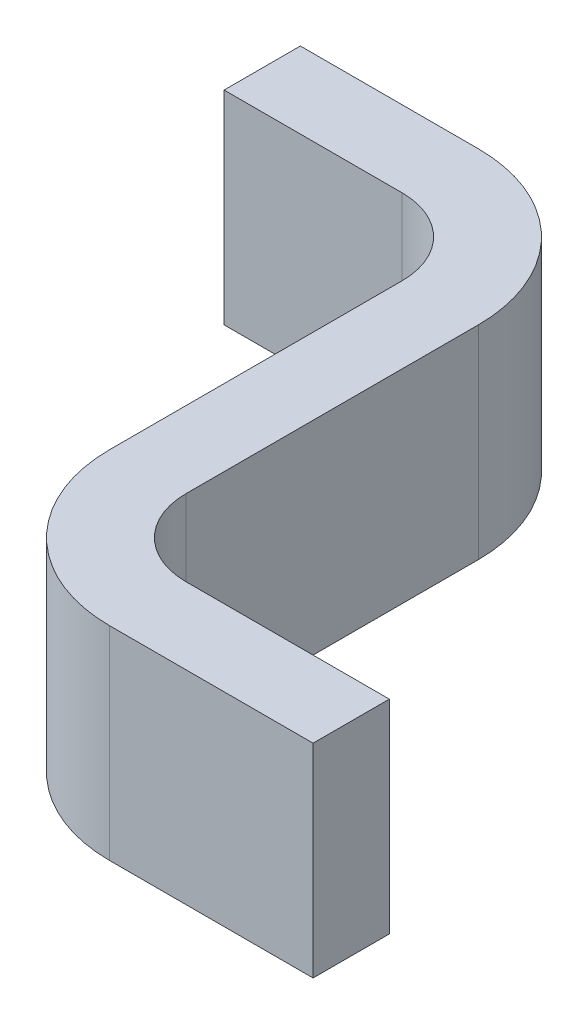
ISO-10303-21;
HEADER;
FILE_DESCRIPTION(('STEP AP214'),'2;1');
FILE_NAME('part.step','',(''),(''),'','','');
FILE_SCHEMA(('AUTOMOTIVE_DESIGN { 1 0 10303 214 1 1 1 1 }'));
ENDSEC;
DATA;
#1=APPLICATION_CONTEXT('core data for automotive mechanical design processes');
#2=APPLICATION_PROTOCOL_DEFINITION('international standard','automotive_design',2000,#1);
#3=PRODUCT_CONTEXT('',#1,'mechanical');
#4=PRODUCT('Part','Part','',(#3));
#5=PRODUCT_RELATED_PRODUCT_CATEGORY('part','',(#4));
#6=PRODUCT_DEFINITION_FORMATION('','',#4);
#7=PRODUCT_DEFINITION_CONTEXT('part definition',#1,'design');
#8=PRODUCT_DEFINITION('design','',#6,#7);
#9=PRODUCT_DEFINITION_SHAPE('','',#8);
#10=(LENGTH_UNIT() NAMED_UNIT(*) SI_UNIT(.MILLI.,.METRE.));
#11=(NAMED_UNIT(*) PLANE_ANGLE_UNIT() SI_UNIT($,.RADIAN.));
#12=(NAMED_UNIT(*) SI_UNIT($,.STERADIAN.) SOLID_ANGLE_UNIT());
#13=UNCERTAINTY_MEASURE_WITH_UNIT(LENGTH_MEASURE(1.E-05),#10,'distance_accuracy_value','');
#14=(GEOMETRIC_REPRESENTATION_CONTEXT(3) GLOBAL_UNCERTAINTY_ASSIGNED_CONTEXT((#13)) GLOBAL_UNIT_ASSIGNED_CONTEXT((#10,
#11,#12)) REPRESENTATION_CONTEXT('',''));
#15=CARTESIAN_POINT('',(0.,0.,0.));
#16=DIRECTION('',(0.,0.,1.));
#17=DIRECTION('',(1.,0.,0.));
#18=AXIS2_PLACEMENT_3D('',#15,#16,#17);
#19=CARTESIAN_POINT('',(-2.825,-1.07,1.175));
#20=DIRECTION('',(0.,1.,0.));
#21=DIRECTION('',(1.,0.,0.));
#22=AXIS2_PLACEMENT_3D('',#19,#20,#21);
#23=PLANE('',#22);
#24=DIRECTION('',(0.,0.,1.));
#25=VECTOR('',#24,1.);
#26=CARTESIAN_POINT('',(-2.75,-1.07,1.175));
#27=LINE('',#26,#25);
#28=CARTESIAN_POINT('',(-2.75,-1.07,0.3));
#29=VERTEX_POINT('',#28);
#30=CARTESIAN_POINT('',(-2.75,-1.07,0.875));
#31=VERTEX_POINT('',#30);
#32=EDGE_CURVE('E20',#29,#31,#27,.T.);
#33=ORIENTED_EDGE('',*,*,#32,.F.);
#34=CARTESIAN_POINT('',(-3.05,-1.07,0.3));
#35=DIRECTION('',(0.,-1.,0.));
#36=DIRECTION('',(0.,0.,1.));
#37=AXIS2_PLACEMENT_3D('',#34,#35,#36);
#38=CIRCLE('',#37,0.3);
#39=CARTESIAN_POINT('',(-3.05,-1.07,0.));
#40=VERTEX_POINT('',#39);
#41=EDGE_CURVE('E211',#40,#29,#38,.T.);
#42=ORIENTED_EDGE('',*,*,#41,.F.);
#43=DIRECTION('',(-1.,0.,0.));
#44=VECTOR('',#43,1.);
#45=CARTESIAN_POINT('',(-2.475,-1.07,0.));
#46=LINE('',#45,#44);
#47=CARTESIAN_POINT('',(-3.4,-1.07,0.));
#48=VERTEX_POINT('',#47);
#49=EDGE_CURVE('E273',#40,#48,#46,.T.);
#50=ORIENTED_EDGE('',*,*,#49,.T.);
#51=DIRECTION('',(0.,0.,-1.));
#52=VECTOR('',#51,1.);
#53=CARTESIAN_POINT('',(-3.4,-1.07,0.));
#54=LINE('',#53,#52);
#55=CARTESIAN_POINT('',(-3.4,-1.07,0.15));
#56=VERTEX_POINT('',#55);
#57=EDGE_CURVE('E262',#56,#48,#54,.T.);
#58=ORIENTED_EDGE('',*,*,#57,.F.);
#59=DIRECTION('',(-1.,0.,0.));
#60=VECTOR('',#59,1.);
#61=CARTESIAN_POINT('',(0.,-1.07,0.15));
#62=LINE('',#61,#60);
#63=CARTESIAN_POINT('',(-3.05,-1.07,0.15));
#64=VERTEX_POINT('',#63);
#65=EDGE_CURVE('E268',#64,#56,#62,.T.);
#66=ORIENTED_EDGE('',*,*,#65,.F.);
#67=CARTESIAN_POINT('',(-3.05,-1.07,0.3));
#68=DIRECTION('',(0.,-1.,0.));
#69=DIRECTION('',(0.,0.,1.));
#70=AXIS2_PLACEMENT_3D('',#67,#68,#69);
#71=CIRCLE('',#70,0.15);
#72=CARTESIAN_POINT('',(-2.9,-1.07,0.3));
#73=VERTEX_POINT('',#72);
#74=EDGE_CURVE('E238',#64,#73,#71,.T.);
#75=ORIENTED_EDGE('',*,*,#74,.T.);
#76=DIRECTION('',(0.,0.,-1.));
#77=VECTOR('',#76,1.);
#78=CARTESIAN_POINT('',(-2.9,-1.07,1.175));
#79=LINE('',#78,#77);
#80=CARTESIAN_POINT('',(-2.9,-1.07,0.875));
#81=VERTEX_POINT('',#80);
#82=EDGE_CURVE('E181',#81,#73,#79,.T.);
#83=ORIENTED_EDGE('',*,*,#82,.F.);
#84=CARTESIAN_POINT('',(-2.6,-1.07,0.875));
#85=DIRECTION('',(0.,-1.,0.));
#86=DIRECTION('',(0.,0.,-1.));
#87=AXIS2_PLACEMENT_3D('',#84,#85,#86);
#88=CIRCLE('',#87,0.3);
#89=CARTESIAN_POINT('',(-2.6,-1.07,1.175));
#90=VERTEX_POINT('',#89);
#91=EDGE_CURVE('E178',#90,#81,#88,.T.);
#92=ORIENTED_EDGE('',*,*,#91,.F.);
#93=DIRECTION('',(-1.,0.,0.));
#94=VECTOR('',#93,1.);
#95=CARTESIAN_POINT('',(-2.475,-1.07,1.175));
#96=LINE('',#95,#94);
#97=CARTESIAN_POINT('',(-2.2,-1.07,1.175));
#98=VERTEX_POINT('',#97);
#99=EDGE_CURVE('E27',#98,#90,#96,.T.);
#100=ORIENTED_EDGE('',*,*,#99,.F.);
#101=DIRECTION('',(0.,0.,1.));
#102=VECTOR('',#101,1.);
#103=CARTESIAN_POINT('',(-2.2,-1.07,1.1));
#104=LINE('',#103,#102);
#105=CARTESIAN_POINT('',(-2.2,-1.07,1.025));
#106=VERTEX_POINT('',#105);
#107=EDGE_CURVE('E11',#106,#98,#104,.T.);
#108=ORIENTED_EDGE('',*,*,#107,.F.);
#109=DIRECTION('',(-1.,0.,0.));
#110=VECTOR('',#109,1.);
#111=CARTESIAN_POINT('',(0.,-1.07,1.025));
#112=LINE('',#111,#110);
#113=CARTESIAN_POINT('',(-2.6,-1.07,1.025));
#114=VERTEX_POINT('',#113);
#115=EDGE_CURVE('E255',#106,#114,#112,.T.);
#116=ORIENTED_EDGE('',*,*,#115,.T.);
#117=CARTESIAN_POINT('',(-2.6,-1.07,0.875));
#118=DIRECTION('',(0.,-1.,0.));
#119=DIRECTION('',(0.,0.,1.));
#120=AXIS2_PLACEMENT_3D('',#117,#118,#119);
#121=CIRCLE('',#120,0.15);
#122=EDGE_CURVE('E150',#114,#31,#121,.T.);
#123=ORIENTED_EDGE('',*,*,#122,.T.);
#124=EDGE_LOOP('',(#33,#42,#50,#58,#66,#75,#83,#92,#100,#108,#116,#123));
#125=FACE_BOUND('',#124,.T.);
#126=ADVANCED_FACE('F16',(#125),#23,.T.);
#127=CARTESIAN_POINT('',(-2.2,-1.27,1.1));
#128=DIRECTION('',(1.,0.,0.));
#129=DIRECTION('',(0.,1.,0.));
#130=AXIS2_PLACEMENT_3D('',#127,#128,#129);
#131=PLANE('',#130);
#132=DIRECTION('',(0.,1.,0.));
#133=VECTOR('',#132,1.);
#134=CARTESIAN_POINT('',(-2.2,1.27,1.175));
#135=LINE('',#134,#133);
#136=CARTESIAN_POINT('',(-2.2,-1.47,1.175));
#137=VERTEX_POINT('',#136);
#138=EDGE_CURVE('E91',#137,#98,#135,.T.);
#139=ORIENTED_EDGE('',*,*,#138,.F.);
#140=DIRECTION('',(0.,0.,1.));
#141=VECTOR('',#140,1.);
#142=CARTESIAN_POINT('',(-2.2,-1.47,0.));
#143=LINE('',#142,#141);
#144=CARTESIAN_POINT('',(-2.2,-1.47,1.025));
#145=VERTEX_POINT('',#144);
#146=EDGE_CURVE('E201',#145,#137,#143,.T.);
#147=ORIENTED_EDGE('',*,*,#146,.F.);
#148=DIRECTION('',(0.,1.,0.));
#149=VECTOR('',#148,1.);
#150=CARTESIAN_POINT('',(-2.2,0.,1.025));
#151=LINE('',#150,#149);
#152=EDGE_CURVE('E103',#145,#106,#151,.T.);
#153=ORIENTED_EDGE('',*,*,#152,.T.);
#154=ORIENTED_EDGE('',*,*,#107,.T.);
#155=EDGE_LOOP('',(#139,#147,#153,#154));
#156=FACE_BOUND('',#155,.T.);
#157=ADVANCED_FACE('F325',(#156),#131,.T.);
#158=CARTESIAN_POINT('',(-2.475,1.27,1.175));
#159=DIRECTION('',(0.,0.,1.));
#160=DIRECTION('',(1.,0.,0.));
#161=AXIS2_PLACEMENT_3D('',#158,#159,#160);
#162=PLANE('',#161);
#163=ORIENTED_EDGE('',*,*,#138,.T.);
#164=ORIENTED_EDGE('',*,*,#99,.T.);
#165=DIRECTION('',(0.,1.,0.));
#166=VECTOR('',#165,1.);
#167=CARTESIAN_POINT('',(-2.6,0.,1.175));
#168=LINE('',#167,#166);
#169=CARTESIAN_POINT('',(-2.6,-1.47,1.175));
#170=VERTEX_POINT('',#169);
#171=EDGE_CURVE('E243',#170,#90,#168,.T.);
#172=ORIENTED_EDGE('',*,*,#171,.F.);
#173=DIRECTION('',(-1.,0.,0.));
#174=VECTOR('',#173,1.);
#175=CARTESIAN_POINT('',(-3.15,-1.47,1.175));
#176=LINE('',#175,#174);
#177=EDGE_CURVE('E193',#137,#170,#176,.T.);
#178=ORIENTED_EDGE('',*,*,#177,.F.);
#179=EDGE_LOOP('',(#163,#164,#172,#178));
#180=FACE_BOUND('',#179,.T.);
#181=ADVANCED_FACE('F303',(#180),#162,.T.);
#182=CARTESIAN_POINT('',(-2.6,0.,0.875));
#183=DIRECTION('',(0.,-1.,0.));
#184=DIRECTION('',(0.,0.,-1.));
#185=AXIS2_PLACEMENT_3D('',#182,#183,#184);
#186=CYLINDRICAL_SURFACE('',#185,0.3);
#187=DIRECTION('',(0.,1.,0.));
#188=VECTOR('',#187,1.);
#189=CARTESIAN_POINT('',(-2.9,-1.27,0.875));
#190=LINE('',#189,#188);
#191=CARTESIAN_POINT('',(-2.9,-1.47,0.875));
#192=VERTEX_POINT('',#191);
#193=EDGE_CURVE('E171',#192,#81,#190,.T.);
#194=ORIENTED_EDGE('',*,*,#193,.F.);
#195=CARTESIAN_POINT('',(-2.6,-1.47,0.875));
#196=DIRECTION('',(0.,-1.,0.));
#197=DIRECTION('',(0.,0.,-1.));
#198=AXIS2_PLACEMENT_3D('',#195,#196,#197);
#199=CIRCLE('',#198,0.3);
#200=EDGE_CURVE('E175',#170,#192,#199,.T.);
#201=ORIENTED_EDGE('',*,*,#200,.F.);
#202=ORIENTED_EDGE('',*,*,#171,.T.);
#203=ORIENTED_EDGE('',*,*,#91,.T.);
#204=EDGE_LOOP('',(#194,#201,#202,#203));
#205=FACE_BOUND('',#204,.T.);
#206=ADVANCED_FACE('F172',(#205),#186,.T.);
#207=CARTESIAN_POINT('',(-2.9,-1.27,1.175));
#208=DIRECTION('',(-1.,0.,0.));
#209=DIRECTION('',(0.,0.,1.));
#210=AXIS2_PLACEMENT_3D('',#207,#208,#209);
#211=PLANE('',#210);
#212=ORIENTED_EDGE('',*,*,#193,.T.);
#213=ORIENTED_EDGE('',*,*,#82,.T.);
#214=DIRECTION('',(0.,-1.,0.));
#215=VECTOR('',#214,1.);
#216=CARTESIAN_POINT('',(-2.9,-0.635,0.3));
#217=LINE('',#216,#215);
#218=CARTESIAN_POINT('',(-2.9,-1.47,0.3));
#219=VERTEX_POINT('',#218);
#220=EDGE_CURVE('E163',#73,#219,#217,.T.);
#221=ORIENTED_EDGE('',*,*,#220,.T.);
#222=DIRECTION('',(0.,0.,-1.));
#223=VECTOR('',#222,1.);
#224=CARTESIAN_POINT('',(-2.9,-1.47,0.));
#225=LINE('',#224,#223);
#226=EDGE_CURVE('E184',#192,#219,#225,.T.);
#227=ORIENTED_EDGE('',*,*,#226,.F.);
#228=EDGE_LOOP('',(#212,#213,#221,#227));
#229=FACE_BOUND('',#228,.T.);
#230=ADVANCED_FACE('F18',(#229),#211,.T.);
#231=CARTESIAN_POINT('',(-3.05,-0.635,0.3));
#232=DIRECTION('',(0.,1.,0.));
#233=DIRECTION('',(0.,0.,1.));
#234=AXIS2_PLACEMENT_3D('',#231,#232,#233);
#235=CYLINDRICAL_SURFACE('',#234,0.15);
#236=ORIENTED_EDGE('',*,*,#74,.F.);
#237=DIRECTION('',(0.,1.,0.));
#238=VECTOR('',#237,1.);
#239=CARTESIAN_POINT('',(-3.05,0.,0.15));
#240=LINE('',#239,#238);
#241=CARTESIAN_POINT('',(-3.05,-1.47,0.15));
#242=VERTEX_POINT('',#241);
#243=EDGE_CURVE('E264',#242,#64,#240,.T.);
#244=ORIENTED_EDGE('',*,*,#243,.F.);
#245=CARTESIAN_POINT('',(-3.05,-1.47,0.3));
#246=DIRECTION('',(0.,1.,0.));
#247=DIRECTION('',(0.,0.,1.));
#248=AXIS2_PLACEMENT_3D('',#245,#246,#247);
#249=CIRCLE('',#248,0.15);
#250=EDGE_CURVE('E188',#219,#242,#249,.T.);
#251=ORIENTED_EDGE('',*,*,#250,.F.);
#252=ORIENTED_EDGE('',*,*,#220,.F.);
#253=EDGE_LOOP('',(#236,#244,#251,#252));
#254=FACE_BOUND('',#253,.T.);
#255=ADVANCED_FACE('F307',(#254),#235,.F.);
#256=CARTESIAN_POINT('',(0.,0.,0.15));
#257=DIRECTION('',(0.,0.,1.));
#258=DIRECTION('',(1.,0.,0.));
#259=AXIS2_PLACEMENT_3D('',#256,#257,#258);
#260=PLANE('',#259);
#261=DIRECTION('',(0.,1.,0.));
#262=VECTOR('',#261,1.);
#263=CARTESIAN_POINT('',(-3.4,-1.27,0.15));
#264=LINE('',#263,#262);
#265=CARTESIAN_POINT('',(-3.4,-1.47,0.15));
#266=VERTEX_POINT('',#265);
#267=EDGE_CURVE('E265',#266,#56,#264,.T.);
#268=ORIENTED_EDGE('',*,*,#267,.F.);
#269=DIRECTION('',(-1.,0.,0.));
#270=VECTOR('',#269,1.);
#271=CARTESIAN_POINT('',(-3.15,-1.47,0.15));
#272=LINE('',#271,#270);
#273=EDGE_CURVE('E207',#242,#266,#272,.T.);
#274=ORIENTED_EDGE('',*,*,#273,.F.);
#275=ORIENTED_EDGE('',*,*,#243,.T.);
#276=ORIENTED_EDGE('',*,*,#65,.T.);
#277=EDGE_LOOP('',(#268,#274,#275,#276));
#278=FACE_BOUND('',#277,.T.);
#279=ADVANCED_FACE('F310',(#278),#260,.T.);
#280=CARTESIAN_POINT('',(-3.4,-1.27,0.));
#281=DIRECTION('',(-1.,0.,0.));
#282=DIRECTION('',(0.,0.,1.));
#283=AXIS2_PLACEMENT_3D('',#280,#281,#282);
#284=PLANE('',#283);
#285=DIRECTION('',(0.,-1.,0.));
#286=VECTOR('',#285,1.);
#287=CARTESIAN_POINT('',(-3.4,1.27,0.));
#288=LINE('',#287,#286);
#289=CARTESIAN_POINT('',(-3.4,-1.47,0.));
#290=VERTEX_POINT('',#289);
#291=EDGE_CURVE('E214',#48,#290,#288,.T.);
#292=ORIENTED_EDGE('',*,*,#291,.T.);
#293=DIRECTION('',(0.,0.,-1.));
#294=VECTOR('',#293,1.);
#295=CARTESIAN_POINT('',(-3.4,-1.47,0.));
#296=LINE('',#295,#294);
#297=EDGE_CURVE('E209',#266,#290,#296,.T.);
#298=ORIENTED_EDGE('',*,*,#297,.F.);
#299=ORIENTED_EDGE('',*,*,#267,.T.);
#300=ORIENTED_EDGE('',*,*,#57,.T.);
#301=EDGE_LOOP('',(#292,#298,#299,#300));
#302=FACE_BOUND('',#301,.T.);
#303=ADVANCED_FACE('F313',(#302),#284,.T.);
#304=CARTESIAN_POINT('',(-2.475,1.27,0.));
#305=DIRECTION('',(0.,0.,1.));
#306=DIRECTION('',(1.,0.,0.));
#307=AXIS2_PLACEMENT_3D('',#304,#305,#306);
#308=PLANE('',#307);
#309=DIRECTION('',(1.,0.,0.));
#310=VECTOR('',#309,1.);
#311=CARTESIAN_POINT('',(-3.15,-1.47,0.));
#312=LINE('',#311,#310);
#313=CARTESIAN_POINT('',(-3.05,-1.47,0.));
#314=VERTEX_POINT('',#313);
#315=EDGE_CURVE('E218',#290,#314,#312,.T.);
#316=ORIENTED_EDGE('',*,*,#315,.F.);
#317=ORIENTED_EDGE('',*,*,#291,.F.);
#318=ORIENTED_EDGE('',*,*,#49,.F.);
#319=DIRECTION('',(0.,1.,0.));
#320=VECTOR('',#319,1.);
#321=CARTESIAN_POINT('',(-3.05,0.,0.));
#322=LINE('',#321,#320);
#323=EDGE_CURVE('E205',#314,#40,#322,.T.);
#324=ORIENTED_EDGE('',*,*,#323,.F.);
#325=EDGE_LOOP('',(#316,#317,#318,#324));
#326=FACE_BOUND('',#325,.T.);
#327=ADVANCED_FACE('F316',(#326),#308,.F.);
#328=CARTESIAN_POINT('',(-3.05,0.,0.3));
#329=DIRECTION('',(0.,1.,0.));
#330=DIRECTION('',(0.,0.,1.));
#331=AXIS2_PLACEMENT_3D('',#328,#329,#330);
#332=CYLINDRICAL_SURFACE('',#331,0.3);
#333=DIRECTION('',(0.,1.,0.));
#334=VECTOR('',#333,1.);
#335=CARTESIAN_POINT('',(-2.75,-1.27,0.3));
#336=LINE('',#335,#334);
#337=CARTESIAN_POINT('',(-2.75,-1.47,0.3));
#338=VERTEX_POINT('',#337);
#339=EDGE_CURVE('E281',#338,#29,#336,.T.);
#340=ORIENTED_EDGE('',*,*,#339,.F.);
#341=CARTESIAN_POINT('',(-3.05,-1.47,0.3));
#342=DIRECTION('',(0.,-1.,0.));
#343=DIRECTION('',(0.,0.,1.));
#344=AXIS2_PLACEMENT_3D('',#341,#342,#343);
#345=CIRCLE('',#344,0.3);
#346=EDGE_CURVE('E221',#314,#338,#345,.T.);
#347=ORIENTED_EDGE('',*,*,#346,.F.);
#348=ORIENTED_EDGE('',*,*,#323,.T.);
#349=ORIENTED_EDGE('',*,*,#41,.T.);
#350=EDGE_LOOP('',(#340,#347,#348,#349));
#351=FACE_BOUND('',#350,.T.);
#352=ADVANCED_FACE('F321',(#351),#332,.T.);
#353=CARTESIAN_POINT('',(-2.75,-1.27,1.175));
#354=DIRECTION('',(1.,0.,0.));
#355=DIRECTION('',(0.,1.,0.));
#356=AXIS2_PLACEMENT_3D('',#353,#354,#355);
#357=PLANE('',#356);
#358=ORIENTED_EDGE('',*,*,#339,.T.);
#359=ORIENTED_EDGE('',*,*,#32,.T.);
#360=DIRECTION('',(0.,-1.,0.));
#361=VECTOR('',#360,1.);
#362=CARTESIAN_POINT('',(-2.75,-0.635,0.875));
#363=LINE('',#362,#361);
#364=CARTESIAN_POINT('',(-2.75,-1.47,0.875));
#365=VERTEX_POINT('',#364);
#366=EDGE_CURVE('E252',#31,#365,#363,.T.);
#367=ORIENTED_EDGE('',*,*,#366,.T.);
#368=DIRECTION('',(0.,0.,1.));
#369=VECTOR('',#368,1.);
#370=CARTESIAN_POINT('',(-2.75,-1.47,0.));
#371=LINE('',#370,#369);
#372=EDGE_CURVE('E229',#338,#365,#371,.T.);
#373=ORIENTED_EDGE('',*,*,#372,.F.);
#374=EDGE_LOOP('',(#358,#359,#367,#373));
#375=FACE_BOUND('',#374,.T.);
#376=ADVANCED_FACE('F348',(#375),#357,.T.);
#377=CARTESIAN_POINT('',(-2.6,-0.635,0.875));
#378=DIRECTION('',(0.,1.,0.));
#379=DIRECTION('',(0.,0.,1.));
#380=AXIS2_PLACEMENT_3D('',#377,#378,#379);
#381=CYLINDRICAL_SURFACE('',#380,0.15);
#382=ORIENTED_EDGE('',*,*,#122,.F.);
#383=DIRECTION('',(0.,-1.,0.));
#384=VECTOR('',#383,1.);
#385=CARTESIAN_POINT('',(-2.6,0.,1.025));
#386=LINE('',#385,#384);
#387=CARTESIAN_POINT('',(-2.6,-1.47,1.025));
#388=VERTEX_POINT('',#387);
#389=EDGE_CURVE('E116',#114,#388,#386,.T.);
#390=ORIENTED_EDGE('',*,*,#389,.T.);
#391=CARTESIAN_POINT('',(-2.6,-1.47,0.875));
#392=DIRECTION('',(0.,1.,0.));
#393=DIRECTION('',(0.,0.,1.));
#394=AXIS2_PLACEMENT_3D('',#391,#392,#393);
#395=CIRCLE('',#394,0.15);
#396=EDGE_CURVE('E247',#365,#388,#395,.T.);
#397=ORIENTED_EDGE('',*,*,#396,.F.);
#398=ORIENTED_EDGE('',*,*,#366,.F.);
#399=EDGE_LOOP('',(#382,#390,#397,#398));
#400=FACE_BOUND('',#399,.T.);
#401=ADVANCED_FACE('F323',(#400),#381,.F.);
#402=CARTESIAN_POINT('',(0.,0.,1.025));
#403=DIRECTION('',(0.,0.,1.));
#404=DIRECTION('',(1.,0.,0.));
#405=AXIS2_PLACEMENT_3D('',#402,#403,#404);
#406=PLANE('',#405);
#407=ORIENTED_EDGE('',*,*,#115,.F.);
#408=ORIENTED_EDGE('',*,*,#152,.F.);
#409=DIRECTION('',(1.,0.,0.));
#410=VECTOR('',#409,1.);
#411=CARTESIAN_POINT('',(-3.15,-1.47,1.025));
#412=LINE('',#411,#410);
#413=EDGE_CURVE('E244',#388,#145,#412,.T.);
#414=ORIENTED_EDGE('',*,*,#413,.F.);
#415=ORIENTED_EDGE('',*,*,#389,.F.);
#416=EDGE_LOOP('',(#407,#408,#414,#415));
#417=FACE_BOUND('',#416,.T.);
#418=ADVANCED_FACE('F324',(#417),#406,.F.);
#419=CARTESIAN_POINT('',(-3.15,-1.47,0.));
#420=DIRECTION('',(0.,-1.,0.));
#421=DIRECTION('',(0.,0.,-1.));
#422=AXIS2_PLACEMENT_3D('',#419,#420,#421);
#423=PLANE('',#422);
#424=ORIENTED_EDGE('',*,*,#396,.T.);
#425=ORIENTED_EDGE('',*,*,#413,.T.);
#426=ORIENTED_EDGE('',*,*,#146,.T.);
#427=ORIENTED_EDGE('',*,*,#177,.T.);
#428=ORIENTED_EDGE('',*,*,#200,.T.);
#429=ORIENTED_EDGE('',*,*,#226,.T.);
#430=ORIENTED_EDGE('',*,*,#250,.T.);
#431=ORIENTED_EDGE('',*,*,#273,.T.);
#432=ORIENTED_EDGE('',*,*,#297,.T.);
#433=ORIENTED_EDGE('',*,*,#315,.T.);
#434=ORIENTED_EDGE('',*,*,#346,.T.);
#435=ORIENTED_EDGE('',*,*,#372,.T.);
#436=EDGE_LOOP('',(#424,#425,#426,#427,#428,#429,#430,#431,#432,#433,#434,#435));
#437=FACE_BOUND('',#436,.T.);
#438=ADVANCED_FACE('F191',(#437),#423,.T.);
#439=CLOSED_SHELL('',(#126,#157,#181,#206,#230,#255,#279,#303,#327,#352,#376,#401,#418,#438));
#440=MANIFOLD_SOLID_BREP('B1',#439);
#441=ADVANCED_BREP_SHAPE_REPRESENTATION('',(#18,#440),#14);
#442=SHAPE_DEFINITION_REPRESENTATION(#9,#441);
ENDSEC;
END-ISO-10303-21;
